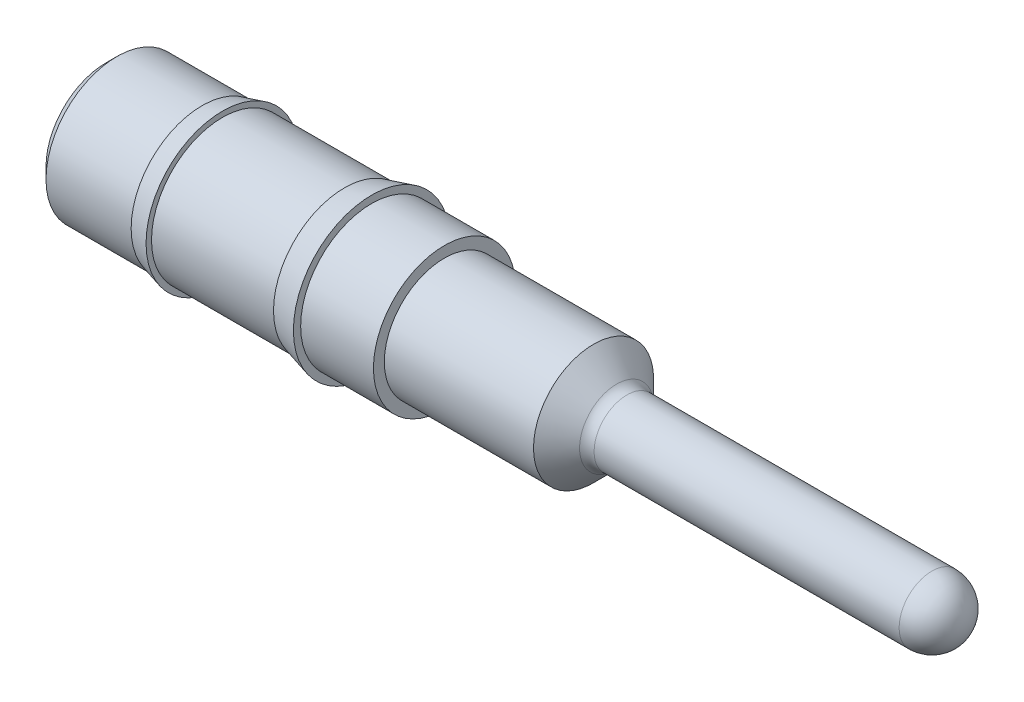
ISO-10303-21;
HEADER;
FILE_DESCRIPTION(('STEP AP214'),'2;1');
FILE_NAME('part.step','',(''),(''),'','','');
FILE_SCHEMA(('AUTOMOTIVE_DESIGN { 1 0 10303 214 1 1 1 1 }'));
ENDSEC;
DATA;
#1=APPLICATION_CONTEXT('core data for automotive mechanical design processes');
#2=APPLICATION_PROTOCOL_DEFINITION('international standard','automotive_design',2000,#1);
#3=PRODUCT_CONTEXT('',#1,'mechanical');
#4=PRODUCT('Part','Part','',(#3));
#5=PRODUCT_RELATED_PRODUCT_CATEGORY('part','',(#4));
#6=PRODUCT_DEFINITION_FORMATION('','',#4);
#7=PRODUCT_DEFINITION_CONTEXT('part definition',#1,'design');
#8=PRODUCT_DEFINITION('design','',#6,#7);
#9=PRODUCT_DEFINITION_SHAPE('','',#8);
#10=(LENGTH_UNIT() NAMED_UNIT(*) SI_UNIT(.MILLI.,.METRE.));
#11=(NAMED_UNIT(*) PLANE_ANGLE_UNIT() SI_UNIT($,.RADIAN.));
#12=(NAMED_UNIT(*) SI_UNIT($,.STERADIAN.) SOLID_ANGLE_UNIT());
#13=UNCERTAINTY_MEASURE_WITH_UNIT(LENGTH_MEASURE(1.E-05),#10,'distance_accuracy_value','');
#14=(GEOMETRIC_REPRESENTATION_CONTEXT(3) GLOBAL_UNCERTAINTY_ASSIGNED_CONTEXT((#13)) GLOBAL_UNIT_ASSIGNED_CONTEXT((#10,
#11,#12)) REPRESENTATION_CONTEXT('',''));
#15=CARTESIAN_POINT('',(0.,0.,0.));
#16=DIRECTION('',(0.,0.,1.));
#17=DIRECTION('',(1.,0.,0.));
#18=AXIS2_PLACEMENT_3D('',#15,#16,#17);
#19=CARTESIAN_POINT('',(5.76579999999998,0.,0.));
#20=DIRECTION('',(-1.,0.,0.));
#21=DIRECTION('',(0.,-1.,0.));
#22=AXIS2_PLACEMENT_3D('',#19,#20,#21);
#23=SPHERICAL_SURFACE('',#22,0.228600000000023);
#24=CARTESIAN_POINT('',(5.76579999999998,0.,0.));
#25=DIRECTION('',(-1.,0.,0.));
#26=DIRECTION('',(0.,0.,1.));
#27=AXIS2_PLACEMENT_3D('',#24,#25,#26);
#28=CIRCLE('',#27,0.228600000000051);
#29=CARTESIAN_POINT('',(5.76579999999998,0.,0.228600000000051));
#30=VERTEX_POINT('',#29);
#31=EDGE_CURVE('E11',#30,#30,#28,.T.);
#32=ORIENTED_EDGE('',*,*,#31,.F.);
#33=EDGE_LOOP('',(#32));
#34=FACE_BOUND('',#33,.T.);
#35=ADVANCED_FACE('F32',(#34),#23,.T.);
#36=CARTESIAN_POINT('',(0.,0.,0.));
#37=DIRECTION('',(-1.,0.,0.));
#38=DIRECTION('',(0.,0.,1.));
#39=AXIS2_PLACEMENT_3D('',#36,#37,#38);
#40=CYLINDRICAL_SURFACE('',#39,0.228600000000046);
#41=CARTESIAN_POINT('',(3.63618409793707,0.,0.));
#42=DIRECTION('',(-1.,0.,0.));
#43=DIRECTION('',(0.,0.,1.));
#44=AXIS2_PLACEMENT_3D('',#41,#42,#43);
#45=CIRCLE('',#44,0.22860000000004);
#46=CARTESIAN_POINT('',(3.63618409793707,0.,0.22860000000004));
#47=VERTEX_POINT('',#46);
#48=EDGE_CURVE('E39',#47,#47,#45,.T.);
#49=ORIENTED_EDGE('',*,*,#48,.F.);
#50=EDGE_LOOP('',(#49));
#51=FACE_BOUND('',#50,.T.);
#52=ORIENTED_EDGE('',*,*,#31,.T.);
#53=EDGE_LOOP('',(#52));
#54=FACE_BOUND('',#53,.T.);
#55=ADVANCED_FACE('F101',(#51,#54),#40,.T.);
#56=CARTESIAN_POINT('',(3.6361840979371,0.,0.));
#57=DIRECTION('',(-1.,0.,0.));
#58=DIRECTION('',(0.,0.,1.));
#59=AXIS2_PLACEMENT_3D('',#56,#57,#58);
#60=TOROIDAL_SURFACE('',#59,0.33020000000003,0.10159999999999);
#61=CARTESIAN_POINT('',(3.56434204896854,0.,0.));
#62=DIRECTION('',(-1.,0.,0.));
#63=DIRECTION('',(0.,0.,1.));
#64=AXIS2_PLACEMENT_3D('',#61,#62,#63);
#65=CIRCLE('',#64,0.258357951031489);
#66=CARTESIAN_POINT('',(3.56434204896854,0.,0.258357951031489));
#67=VERTEX_POINT('',#66);
#68=EDGE_CURVE('E93',#67,#67,#65,.T.);
#69=ORIENTED_EDGE('',*,*,#68,.F.);
#70=EDGE_LOOP('',(#69));
#71=FACE_BOUND('',#70,.T.);
#72=ORIENTED_EDGE('',*,*,#48,.T.);
#73=EDGE_LOOP('',(#72));
#74=FACE_BOUND('',#73,.T.);
#75=ADVANCED_FACE('F99',(#71,#74),#60,.F.);
#76=CARTESIAN_POINT('',(3.56434204896854,0.,0.));
#77=DIRECTION('',(-1.,0.,0.));
#78=DIRECTION('',(0.,0.,1.));
#79=AXIS2_PLACEMENT_3D('',#76,#77,#78);
#80=CONICAL_SURFACE('',#79,0.258357951031489,0.785398163397491);
#81=CARTESIAN_POINT('',(3.40360000000003,0.,0.));
#82=DIRECTION('',(-1.,0.,0.));
#83=DIRECTION('',(0.,0.,1.));
#84=AXIS2_PLACEMENT_3D('',#81,#82,#83);
#85=CIRCLE('',#84,0.419100000000006);
#86=CARTESIAN_POINT('',(3.40360000000003,0.,0.419100000000006));
#87=VERTEX_POINT('',#86);
#88=EDGE_CURVE('E90',#87,#87,#85,.T.);
#89=ORIENTED_EDGE('',*,*,#88,.F.);
#90=EDGE_LOOP('',(#89));
#91=FACE_BOUND('',#90,.T.);
#92=ORIENTED_EDGE('',*,*,#68,.T.);
#93=EDGE_LOOP('',(#92));
#94=FACE_BOUND('',#93,.T.);
#95=ADVANCED_FACE('F119',(#91,#94),#80,.T.);
#96=CARTESIAN_POINT('',(0.,0.,0.));
#97=DIRECTION('',(-1.,0.,0.));
#98=DIRECTION('',(0.,0.,1.));
#99=AXIS2_PLACEMENT_3D('',#96,#97,#98);
#100=CYLINDRICAL_SURFACE('',#99,0.419100000000006);
#101=CARTESIAN_POINT('',(2.36220000000002,0.,0.));
#102=DIRECTION('',(-1.,0.,0.));
#103=DIRECTION('',(0.,0.,1.));
#104=AXIS2_PLACEMENT_3D('',#101,#102,#103);
#105=CIRCLE('',#104,0.419100000000006);
#106=CARTESIAN_POINT('',(2.36220000000002,0.,0.419100000000006));
#107=VERTEX_POINT('',#106);
#108=EDGE_CURVE('E87',#107,#107,#105,.T.);
#109=ORIENTED_EDGE('',*,*,#108,.F.);
#110=EDGE_LOOP('',(#109));
#111=FACE_BOUND('',#110,.T.);
#112=ORIENTED_EDGE('',*,*,#88,.T.);
#113=EDGE_LOOP('',(#112));
#114=FACE_BOUND('',#113,.T.);
#115=ADVANCED_FACE('F127',(#111,#114),#100,.T.);
#116=CARTESIAN_POINT('',(2.36220000000002,0.495300000000032,0.));
#117=DIRECTION('',(-1.,0.,0.));
#118=DIRECTION('',(0.,0.,1.));
#119=AXIS2_PLACEMENT_3D('',#116,#117,#118);
#120=PLANE('',#119);
#121=CARTESIAN_POINT('',(2.36220000000002,0.,0.));
#122=DIRECTION('',(-1.,0.,0.));
#123=DIRECTION('',(0.,0.,1.));
#124=AXIS2_PLACEMENT_3D('',#121,#122,#123);
#125=CIRCLE('',#124,0.495300000000032);
#126=CARTESIAN_POINT('',(2.36220000000002,0.,0.495300000000032));
#127=VERTEX_POINT('',#126);
#128=EDGE_CURVE('E84',#127,#127,#125,.T.);
#129=ORIENTED_EDGE('',*,*,#128,.F.);
#130=EDGE_LOOP('',(#129));
#131=FACE_BOUND('',#130,.T.);
#132=ORIENTED_EDGE('',*,*,#108,.T.);
#133=EDGE_LOOP('',(#132));
#134=FACE_BOUND('',#133,.T.);
#135=ADVANCED_FACE('F135',(#131,#134),#120,.F.);
#136=CARTESIAN_POINT('',(0.,0.,0.));
#137=DIRECTION('',(-1.,0.,0.));
#138=DIRECTION('',(0.,0.,1.));
#139=AXIS2_PLACEMENT_3D('',#136,#137,#138);
#140=CYLINDRICAL_SURFACE('',#139,0.495300000000032);
#141=CARTESIAN_POINT('',(1.85419999999999,0.,0.));
#142=DIRECTION('',(-1.,0.,0.));
#143=DIRECTION('',(0.,0.,1.));
#144=AXIS2_PLACEMENT_3D('',#141,#142,#143);
#145=CIRCLE('',#144,0.495300000000032);
#146=CARTESIAN_POINT('',(1.85419999999999,0.,0.495300000000032));
#147=VERTEX_POINT('',#146);
#148=EDGE_CURVE('E81',#147,#147,#145,.T.);
#149=ORIENTED_EDGE('',*,*,#148,.F.);
#150=EDGE_LOOP('',(#149));
#151=FACE_BOUND('',#150,.T.);
#152=ORIENTED_EDGE('',*,*,#128,.T.);
#153=EDGE_LOOP('',(#152));
#154=FACE_BOUND('',#153,.T.);
#155=ADVANCED_FACE('F143',(#151,#154),#140,.T.);
#156=CARTESIAN_POINT('',(1.85419999999999,0.546100000000077,0.));
#157=DIRECTION('',(-1.,0.,0.));
#158=DIRECTION('',(0.,0.,1.));
#159=AXIS2_PLACEMENT_3D('',#156,#157,#158);
#160=PLANE('',#159);
#161=CARTESIAN_POINT('',(1.85419999999999,0.,0.));
#162=DIRECTION('',(-1.,0.,0.));
#163=DIRECTION('',(0.,0.,1.));
#164=AXIS2_PLACEMENT_3D('',#161,#162,#163);
#165=CIRCLE('',#164,0.546100000000077);
#166=CARTESIAN_POINT('',(1.85419999999999,0.,0.546100000000077));
#167=VERTEX_POINT('',#166);
#168=EDGE_CURVE('E78',#167,#167,#165,.T.);
#169=ORIENTED_EDGE('',*,*,#168,.F.);
#170=EDGE_LOOP('',(#169));
#171=FACE_BOUND('',#170,.T.);
#172=ORIENTED_EDGE('',*,*,#148,.T.);
#173=EDGE_LOOP('',(#172));
#174=FACE_BOUND('',#173,.T.);
#175=ADVANCED_FACE('F151',(#171,#174),#160,.F.);
#176=CARTESIAN_POINT('',(1.85419999999999,0.,0.));
#177=DIRECTION('',(1.,0.,0.));
#178=DIRECTION('',(0.,0.,-1.));
#179=AXIS2_PLACEMENT_3D('',#176,#177,#178);
#180=CONICAL_SURFACE('',#179,0.546100000000077,0.261799387799502);
#181=CARTESIAN_POINT('',(1.66461181897559,0.,0.));
#182=DIRECTION('',(-1.,0.,0.));
#183=DIRECTION('',(0.,0.,1.));
#184=AXIS2_PLACEMENT_3D('',#181,#182,#183);
#185=CIRCLE('',#184,0.495300000000032);
#186=CARTESIAN_POINT('',(1.66461181897559,0.,0.495300000000032));
#187=VERTEX_POINT('',#186);
#188=EDGE_CURVE('E75',#187,#187,#185,.T.);
#189=ORIENTED_EDGE('',*,*,#188,.F.);
#190=EDGE_LOOP('',(#189));
#191=FACE_BOUND('',#190,.T.);
#192=ORIENTED_EDGE('',*,*,#168,.T.);
#193=EDGE_LOOP('',(#192));
#194=FACE_BOUND('',#193,.T.);
#195=ADVANCED_FACE('F159',(#191,#194),#180,.T.);
#196=CARTESIAN_POINT('',(0.,0.,0.));
#197=DIRECTION('',(-1.,0.,0.));
#198=DIRECTION('',(0.,0.,1.));
#199=AXIS2_PLACEMENT_3D('',#196,#197,#198);
#200=CYLINDRICAL_SURFACE('',#199,0.495300000000032);
#201=CARTESIAN_POINT('',(0.812800000000044,0.,0.));
#202=DIRECTION('',(-1.,0.,0.));
#203=DIRECTION('',(0.,0.,1.));
#204=AXIS2_PLACEMENT_3D('',#201,#202,#203);
#205=CIRCLE('',#204,0.495300000000032);
#206=CARTESIAN_POINT('',(0.812800000000044,0.,0.495300000000032));
#207=VERTEX_POINT('',#206);
#208=EDGE_CURVE('E72',#207,#207,#205,.T.);
#209=ORIENTED_EDGE('',*,*,#208,.F.);
#210=EDGE_LOOP('',(#209));
#211=FACE_BOUND('',#210,.T.);
#212=ORIENTED_EDGE('',*,*,#188,.T.);
#213=EDGE_LOOP('',(#212));
#214=FACE_BOUND('',#213,.T.);
#215=ADVANCED_FACE('F167',(#211,#214),#200,.T.);
#216=CARTESIAN_POINT('',(0.812800000000044,0.533400000000045,0.));
#217=DIRECTION('',(-1.,0.,0.));
#218=DIRECTION('',(0.,0.,1.));
#219=AXIS2_PLACEMENT_3D('',#216,#217,#218);
#220=PLANE('',#219);
#221=CARTESIAN_POINT('',(0.812800000000044,0.,0.));
#222=DIRECTION('',(-1.,0.,0.));
#223=DIRECTION('',(0.,0.,1.));
#224=AXIS2_PLACEMENT_3D('',#221,#222,#223);
#225=CIRCLE('',#224,0.533400000000045);
#226=CARTESIAN_POINT('',(0.812800000000044,0.,0.533400000000045));
#227=VERTEX_POINT('',#226);
#228=EDGE_CURVE('E69',#227,#227,#225,.T.);
#229=ORIENTED_EDGE('',*,*,#228,.F.);
#230=EDGE_LOOP('',(#229));
#231=FACE_BOUND('',#230,.T.);
#232=ORIENTED_EDGE('',*,*,#208,.T.);
#233=EDGE_LOOP('',(#232));
#234=FACE_BOUND('',#233,.T.);
#235=ADVANCED_FACE('F175',(#231,#234),#220,.F.);
#236=CARTESIAN_POINT('',(0.812800000000044,0.,0.));
#237=DIRECTION('',(1.,0.,0.));
#238=DIRECTION('',(0.,0.,-1.));
#239=AXIS2_PLACEMENT_3D('',#236,#237,#238);
#240=CONICAL_SURFACE('',#239,0.533400000000045,0.261799387799489);
#241=CARTESIAN_POINT('',(0.670608864231814,0.,0.));
#242=DIRECTION('',(-1.,0.,0.));
#243=DIRECTION('',(0.,0.,1.));
#244=AXIS2_PLACEMENT_3D('',#241,#242,#243);
#245=CIRCLE('',#244,0.495300000000032);
#246=CARTESIAN_POINT('',(0.670608864231814,0.,0.495300000000032));
#247=VERTEX_POINT('',#246);
#248=EDGE_CURVE('E66',#247,#247,#245,.T.);
#249=ORIENTED_EDGE('',*,*,#248,.F.);
#250=EDGE_LOOP('',(#249));
#251=FACE_BOUND('',#250,.T.);
#252=ORIENTED_EDGE('',*,*,#228,.T.);
#253=EDGE_LOOP('',(#252));
#254=FACE_BOUND('',#253,.T.);
#255=ADVANCED_FACE('F183',(#251,#254),#240,.T.);
#256=CARTESIAN_POINT('',(0.,0.,0.));
#257=DIRECTION('',(-1.,0.,0.));
#258=DIRECTION('',(0.,0.,1.));
#259=AXIS2_PLACEMENT_3D('',#256,#257,#258);
#260=CYLINDRICAL_SURFACE('',#259,0.495300000000032);
#261=CARTESIAN_POINT('',(0.0761999999997626,0.,0.));
#262=DIRECTION('',(-1.,0.,0.));
#263=DIRECTION('',(0.,0.,1.));
#264=AXIS2_PLACEMENT_3D('',#261,#262,#263);
#265=CIRCLE('',#264,0.495300000000032);
#266=CARTESIAN_POINT('',(0.0761999999997626,0.,0.495300000000032));
#267=VERTEX_POINT('',#266);
#268=EDGE_CURVE('E63',#267,#267,#265,.T.);
#269=ORIENTED_EDGE('',*,*,#268,.F.);
#270=EDGE_LOOP('',(#269));
#271=FACE_BOUND('',#270,.T.);
#272=ORIENTED_EDGE('',*,*,#248,.T.);
#273=EDGE_LOOP('',(#272));
#274=FACE_BOUND('',#273,.T.);
#275=ADVANCED_FACE('F191',(#271,#274),#260,.T.);
#276=CARTESIAN_POINT('',(0.0761999999997626,0.,0.));
#277=DIRECTION('',(1.,0.,0.));
#278=DIRECTION('',(0.,0.,-1.));
#279=AXIS2_PLACEMENT_3D('',#276,#277,#278);
#280=CONICAL_SURFACE('',#279,0.495300000000032,0.785398163398085);
#281=CARTESIAN_POINT('',(0.,0.,0.));
#282=DIRECTION('',(-1.,0.,0.));
#283=DIRECTION('',(0.,0.,1.));
#284=AXIS2_PLACEMENT_3D('',#281,#282,#283);
#285=CIRCLE('',#284,0.419100000000172);
#286=CARTESIAN_POINT('',(0.,0.,0.419100000000172));
#287=VERTEX_POINT('',#286);
#288=EDGE_CURVE('E60',#287,#287,#285,.T.);
#289=ORIENTED_EDGE('',*,*,#288,.F.);
#290=EDGE_LOOP('',(#289));
#291=FACE_BOUND('',#290,.T.);
#292=ORIENTED_EDGE('',*,*,#268,.T.);
#293=EDGE_LOOP('',(#292));
#294=FACE_BOUND('',#293,.T.);
#295=ADVANCED_FACE('F199',(#291,#294),#280,.T.);
#296=CARTESIAN_POINT('',(0.,0.,0.));
#297=DIRECTION('',(1.,0.,0.));
#298=DIRECTION('',(0.,0.,-1.));
#299=AXIS2_PLACEMENT_3D('',#296,#297,#298);
#300=PLANE('',#299);
#301=CARTESIAN_POINT('',(0.,0.,0.));
#302=DIRECTION('',(-1.,0.,0.));
#303=DIRECTION('',(0.,0.,1.));
#304=AXIS2_PLACEMENT_3D('',#301,#302,#303);
#305=CIRCLE('',#304,0.3937);
#306=CARTESIAN_POINT('',(0.,0.,0.3937));
#307=VERTEX_POINT('',#306);
#308=EDGE_CURVE('E53',#307,#307,#305,.T.);
#309=ORIENTED_EDGE('',*,*,#308,.F.);
#310=EDGE_LOOP('',(#309));
#311=FACE_BOUND('',#310,.T.);
#312=ORIENTED_EDGE('',*,*,#288,.T.);
#313=EDGE_LOOP('',(#312));
#314=FACE_BOUND('',#313,.T.);
#315=ADVANCED_FACE('F207',(#311,#314),#300,.F.);
#316=CARTESIAN_POINT('',(2.1082,0.,0.));
#317=DIRECTION('',(-1.,0.,0.));
#318=DIRECTION('',(0.,0.,1.));
#319=AXIS2_PLACEMENT_3D('',#316,#317,#318);
#320=CONICAL_SURFACE('',#319,0.3937,1.02974425867667);
#321=CARTESIAN_POINT('',(2.17687836875486,0.,0.));
#322=DIRECTION('',(-1.,0.,0.));
#323=DIRECTION('',(0.,0.,1.));
#324=AXIS2_PLACEMENT_3D('',#321,#322,#323);
#325=CIRCLE('',#324,0.279399999999992);
#326=CARTESIAN_POINT('',(2.17687836875486,0.,0.279399999999992));
#327=VERTEX_POINT('',#326);
#328=EDGE_CURVE('E35',#327,#327,#325,.F.);
#329=ORIENTED_EDGE('',*,*,#328,.T.);
#330=EDGE_LOOP('',(#329));
#331=FACE_BOUND('',#330,.T.);
#332=CARTESIAN_POINT('',(2.1082,0.,0.));
#333=DIRECTION('',(-1.,0.,0.));
#334=DIRECTION('',(0.,0.,1.));
#335=AXIS2_PLACEMENT_3D('',#332,#333,#334);
#336=CIRCLE('',#335,0.3937);
#337=CARTESIAN_POINT('',(2.1082,0.,0.3937));
#338=VERTEX_POINT('',#337);
#339=EDGE_CURVE('E57',#338,#338,#336,.T.);
#340=ORIENTED_EDGE('',*,*,#339,.T.);
#341=EDGE_LOOP('',(#340));
#342=FACE_BOUND('',#341,.T.);
#343=ADVANCED_FACE('F215',(#331,#342),#320,.F.);
#344=CARTESIAN_POINT('',(0.,0.,0.));
#345=DIRECTION('',(-1.,0.,0.));
#346=DIRECTION('',(0.,0.,1.));
#347=AXIS2_PLACEMENT_3D('',#344,#345,#346);
#348=CYLINDRICAL_SURFACE('',#347,0.3937);
#349=ORIENTED_EDGE('',*,*,#339,.F.);
#350=EDGE_LOOP('',(#349));
#351=FACE_BOUND('',#350,.T.);
#352=ORIENTED_EDGE('',*,*,#308,.T.);
#353=EDGE_LOOP('',(#352));
#354=FACE_BOUND('',#353,.T.);
#355=ADVANCED_FACE('F224',(#351,#354),#348,.F.);
#356=CARTESIAN_POINT('',(0.,0.,0.));
#357=DIRECTION('',(-1.,0.,0.));
#358=DIRECTION('',(0.,0.,1.));
#359=AXIS2_PLACEMENT_3D('',#356,#357,#358);
#360=CYLINDRICAL_SURFACE('',#359,0.279399999999992);
#361=CARTESIAN_POINT('',(3.048,0.,0.));
#362=DIRECTION('',(-1.,0.,0.));
#363=DIRECTION('',(0.,0.,1.));
#364=AXIS2_PLACEMENT_3D('',#361,#362,#363);
#365=CIRCLE('',#364,0.279399999999992);
#366=CARTESIAN_POINT('',(3.048,0.,0.279399999999992));
#367=VERTEX_POINT('',#366);
#368=EDGE_CURVE('E49',#367,#367,#365,.T.);
#369=ORIENTED_EDGE('',*,*,#368,.F.);
#370=EDGE_LOOP('',(#369));
#371=FACE_BOUND('',#370,.T.);
#372=ORIENTED_EDGE('',*,*,#328,.F.);
#373=EDGE_LOOP('',(#372));
#374=FACE_BOUND('',#373,.T.);
#375=ADVANCED_FACE('F45',(#371,#374),#360,.F.);
#376=CARTESIAN_POINT('',(3.048,0.,0.));
#377=DIRECTION('',(-1.,0.,0.));
#378=DIRECTION('',(0.,0.,1.));
#379=AXIS2_PLACEMENT_3D('',#376,#377,#378);
#380=CONICAL_SURFACE('',#379,0.279399999999992,1.02974425867662);
#381=CARTESIAN_POINT('',(3.2158804569563,0.,0.));
#382=VERTEX_POINT('',#381);
#383=VERTEX_LOOP('',#382);
#384=FACE_BOUND('',#383,.T.);
#385=ORIENTED_EDGE('',*,*,#368,.T.);
#386=EDGE_LOOP('',(#385));
#387=FACE_BOUND('',#386,.T.);
#388=ADVANCED_FACE('F42',(#384,#387),#380,.F.);
#389=CLOSED_SHELL('',(#35,#55,#75,#95,#115,#135,#155,#175,#195,#215,#235,#255,#275,#295,#315,
#343,#355,#375,#388));
#390=MANIFOLD_SOLID_BREP('B2',#389);
#391=ADVANCED_BREP_SHAPE_REPRESENTATION('',(#18,#390),#14);
#392=SHAPE_DEFINITION_REPRESENTATION(#9,#391);
ENDSEC;
END-ISO-10303-21;
